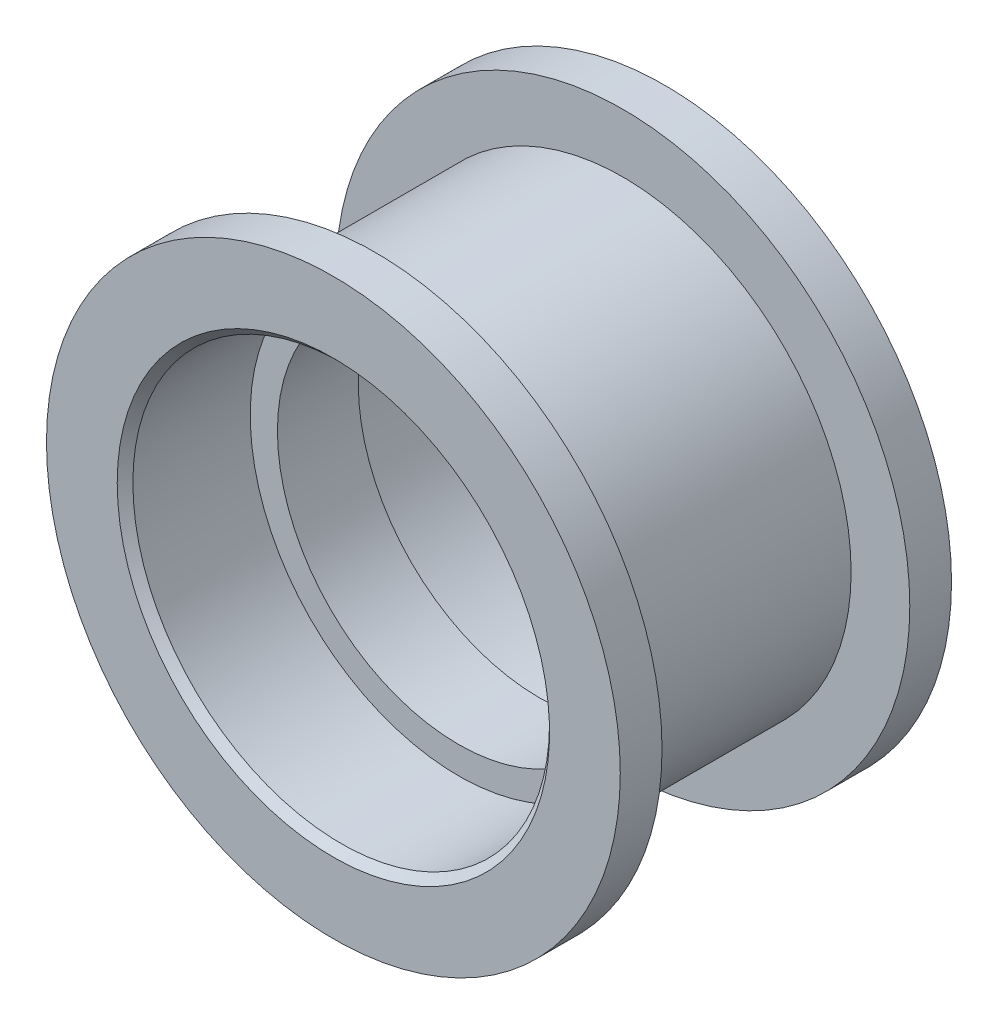
ISO-10303-21;
HEADER;
FILE_DESCRIPTION(('STEP AP214'),'2;1');
FILE_NAME('part.step','',(''),(''),'','','');
FILE_SCHEMA(('AUTOMOTIVE_DESIGN { 1 0 10303 214 1 1 1 1 }'));
ENDSEC;
DATA;
#1=APPLICATION_CONTEXT('core data for automotive mechanical design processes');
#2=APPLICATION_PROTOCOL_DEFINITION('international standard','automotive_design',2000,#1);
#3=PRODUCT_CONTEXT('',#1,'mechanical');
#4=PRODUCT('Part','Part','',(#3));
#5=PRODUCT_RELATED_PRODUCT_CATEGORY('part','',(#4));
#6=PRODUCT_DEFINITION_FORMATION('','',#4);
#7=PRODUCT_DEFINITION_CONTEXT('part definition',#1,'design');
#8=PRODUCT_DEFINITION('design','',#6,#7);
#9=PRODUCT_DEFINITION_SHAPE('','',#8);
#10=(LENGTH_UNIT() NAMED_UNIT(*) SI_UNIT(.MILLI.,.METRE.));
#11=(NAMED_UNIT(*) PLANE_ANGLE_UNIT() SI_UNIT($,.RADIAN.));
#12=(NAMED_UNIT(*) SI_UNIT($,.STERADIAN.) SOLID_ANGLE_UNIT());
#13=UNCERTAINTY_MEASURE_WITH_UNIT(LENGTH_MEASURE(1.E-05),#10,'distance_accuracy_value','');
#14=(GEOMETRIC_REPRESENTATION_CONTEXT(3) GLOBAL_UNCERTAINTY_ASSIGNED_CONTEXT((#13)) GLOBAL_UNIT_ASSIGNED_CONTEXT((#10,
#11,#12)) REPRESENTATION_CONTEXT('',''));
#15=CARTESIAN_POINT('',(0.,0.,0.));
#16=DIRECTION('',(0.,0.,1.));
#17=DIRECTION('',(1.,0.,0.));
#18=AXIS2_PLACEMENT_3D('',#15,#16,#17);
#19=CARTESIAN_POINT('',(0.,0.,0.));
#20=DIRECTION('',(0.,0.,1.));
#21=DIRECTION('',(1.,0.,0.));
#22=AXIS2_PLACEMENT_3D('',#19,#20,#21);
#23=CYLINDRICAL_SURFACE('',#22,6.945);
#24=CARTESIAN_POINT('',(0.,0.,-1.55));
#25=DIRECTION('',(0.,0.,1.));
#26=DIRECTION('',(1.,0.,0.));
#27=AXIS2_PLACEMENT_3D('',#24,#25,#26);
#28=CIRCLE('',#27,6.945);
#29=CARTESIAN_POINT('',(6.945,0.,-1.55));
#30=VERTEX_POINT('',#29);
#31=EDGE_CURVE('E78',#30,#30,#28,.T.);
#32=ORIENTED_EDGE('',*,*,#31,.F.);
#33=EDGE_LOOP('',(#32));
#34=FACE_BOUND('',#33,.T.);
#35=CARTESIAN_POINT('',(0.,0.,1.55));
#36=DIRECTION('',(0.,0.,1.));
#37=DIRECTION('',(1.,0.,0.));
#38=AXIS2_PLACEMENT_3D('',#35,#36,#37);
#39=CIRCLE('',#38,6.945);
#40=CARTESIAN_POINT('',(6.945,0.,1.55));
#41=VERTEX_POINT('',#40);
#42=EDGE_CURVE('E51',#41,#41,#39,.T.);
#43=ORIENTED_EDGE('',*,*,#42,.T.);
#44=EDGE_LOOP('',(#43));
#45=FACE_BOUND('',#44,.T.);
#46=ADVANCED_FACE('F31',(#34,#45),#23,.F.);
#47=CARTESIAN_POINT('',(0.,7.9875,1.55));
#48=DIRECTION('',(0.,0.,-1.));
#49=DIRECTION('',(-1.,0.,0.));
#50=AXIS2_PLACEMENT_3D('',#47,#48,#49);
#51=PLANE('',#50);
#52=ORIENTED_EDGE('',*,*,#42,.F.);
#53=EDGE_LOOP('',(#52));
#54=FACE_BOUND('',#53,.T.);
#55=CARTESIAN_POINT('',(0.,0.,1.55));
#56=DIRECTION('',(0.,0.,1.));
#57=DIRECTION('',(1.,0.,0.));
#58=AXIS2_PLACEMENT_3D('',#55,#56,#57);
#59=CIRCLE('',#58,7.9875);
#60=CARTESIAN_POINT('',(7.9875,0.,1.55));
#61=VERTEX_POINT('',#60);
#62=EDGE_CURVE('E54',#61,#61,#59,.T.);
#63=ORIENTED_EDGE('',*,*,#62,.T.);
#64=EDGE_LOOP('',(#63));
#65=FACE_BOUND('',#64,.T.);
#66=ADVANCED_FACE('F86',(#54,#65),#51,.F.);
#67=CARTESIAN_POINT('',(0.,0.,0.));
#68=DIRECTION('',(0.,0.,1.));
#69=DIRECTION('',(1.,0.,0.));
#70=AXIS2_PLACEMENT_3D('',#67,#68,#69);
#71=CYLINDRICAL_SURFACE('',#70,7.9875);
#72=CARTESIAN_POINT('',(0.,0.,6.05000000000001));
#73=DIRECTION('',(0.,0.,-1.));
#74=DIRECTION('',(-1.,0.,0.));
#75=AXIS2_PLACEMENT_3D('',#72,#73,#74);
#76=CIRCLE('',#75,7.9875);
#77=CARTESIAN_POINT('',(-7.9875,0.,6.05000000000001));
#78=VERTEX_POINT('',#77);
#79=EDGE_CURVE('E38',#78,#78,#76,.F.);
#80=ORIENTED_EDGE('',*,*,#79,.T.);
#81=EDGE_LOOP('',(#80));
#82=FACE_BOUND('',#81,.T.);
#83=ORIENTED_EDGE('',*,*,#62,.F.);
#84=EDGE_LOOP('',(#83));
#85=FACE_BOUND('',#84,.T.);
#86=ADVANCED_FACE('F92',(#82,#85),#71,.F.);
#87=CARTESIAN_POINT('',(0.,11.,6.35));
#88=DIRECTION('',(0.,0.,-1.));
#89=DIRECTION('',(-1.,0.,0.));
#90=AXIS2_PLACEMENT_3D('',#87,#88,#89);
#91=PLANE('',#90);
#92=CARTESIAN_POINT('',(0.,0.,6.35));
#93=DIRECTION('',(0.,0.,-1.));
#94=DIRECTION('',(-1.,0.,0.));
#95=AXIS2_PLACEMENT_3D('',#92,#93,#94);
#96=CIRCLE('',#95,8.28749999999999);
#97=CARTESIAN_POINT('',(-8.28749999999999,0.,6.35));
#98=VERTEX_POINT('',#97);
#99=EDGE_CURVE('E10',#98,#98,#96,.T.);
#100=ORIENTED_EDGE('',*,*,#99,.T.);
#101=EDGE_LOOP('',(#100));
#102=FACE_BOUND('',#101,.T.);
#103=CARTESIAN_POINT('',(0.,0.,6.35));
#104=DIRECTION('',(0.,0.,1.));
#105=DIRECTION('',(1.,0.,0.));
#106=AXIS2_PLACEMENT_3D('',#103,#104,#105);
#107=CIRCLE('',#106,11.);
#108=CARTESIAN_POINT('',(11.,0.,6.35));
#109=VERTEX_POINT('',#108);
#110=EDGE_CURVE('E57',#109,#109,#107,.T.);
#111=ORIENTED_EDGE('',*,*,#110,.T.);
#112=EDGE_LOOP('',(#111));
#113=FACE_BOUND('',#112,.T.);
#114=ADVANCED_FACE('F97',(#102,#113),#91,.F.);
#115=CARTESIAN_POINT('',(0.,0.,0.));
#116=DIRECTION('',(0.,0.,1.));
#117=DIRECTION('',(1.,0.,0.));
#118=AXIS2_PLACEMENT_3D('',#115,#116,#117);
#119=CYLINDRICAL_SURFACE('',#118,11.);
#120=ORIENTED_EDGE('',*,*,#110,.F.);
#121=EDGE_LOOP('',(#120));
#122=FACE_BOUND('',#121,.T.);
#123=CARTESIAN_POINT('',(0.,0.,4.75));
#124=DIRECTION('',(0.,0.,1.));
#125=DIRECTION('',(1.,0.,0.));
#126=AXIS2_PLACEMENT_3D('',#123,#124,#125);
#127=CIRCLE('',#126,11.);
#128=CARTESIAN_POINT('',(11.,0.,4.75));
#129=VERTEX_POINT('',#128);
#130=EDGE_CURVE('E60',#129,#129,#127,.T.);
#131=ORIENTED_EDGE('',*,*,#130,.T.);
#132=EDGE_LOOP('',(#131));
#133=FACE_BOUND('',#132,.T.);
#134=ADVANCED_FACE('F102',(#122,#133),#119,.T.);
#135=CARTESIAN_POINT('',(0.,8.75,4.75));
#136=DIRECTION('',(0.,0.,1.));
#137=DIRECTION('',(1.,0.,0.));
#138=AXIS2_PLACEMENT_3D('',#135,#136,#137);
#139=PLANE('',#138);
#140=ORIENTED_EDGE('',*,*,#130,.F.);
#141=EDGE_LOOP('',(#140));
#142=FACE_BOUND('',#141,.T.);
#143=CARTESIAN_POINT('',(0.,0.,4.75));
#144=DIRECTION('',(0.,0.,1.));
#145=DIRECTION('',(1.,0.,0.));
#146=AXIS2_PLACEMENT_3D('',#143,#144,#145);
#147=CIRCLE('',#146,8.75);
#148=CARTESIAN_POINT('',(8.75,0.,4.75));
#149=VERTEX_POINT('',#148);
#150=EDGE_CURVE('E63',#149,#149,#147,.T.);
#151=ORIENTED_EDGE('',*,*,#150,.T.);
#152=EDGE_LOOP('',(#151));
#153=FACE_BOUND('',#152,.T.);
#154=ADVANCED_FACE('F142',(#142,#153),#139,.F.);
#155=CARTESIAN_POINT('',(0.,0.,0.));
#156=DIRECTION('',(0.,0.,1.));
#157=DIRECTION('',(1.,0.,0.));
#158=AXIS2_PLACEMENT_3D('',#155,#156,#157);
#159=CYLINDRICAL_SURFACE('',#158,8.75);
#160=ORIENTED_EDGE('',*,*,#150,.F.);
#161=EDGE_LOOP('',(#160));
#162=FACE_BOUND('',#161,.T.);
#163=CARTESIAN_POINT('',(0.,0.,-4.75));
#164=DIRECTION('',(0.,0.,1.));
#165=DIRECTION('',(1.,0.,0.));
#166=AXIS2_PLACEMENT_3D('',#163,#164,#165);
#167=CIRCLE('',#166,8.75);
#168=CARTESIAN_POINT('',(8.75,0.,-4.75));
#169=VERTEX_POINT('',#168);
#170=EDGE_CURVE('E66',#169,#169,#167,.T.);
#171=ORIENTED_EDGE('',*,*,#170,.T.);
#172=EDGE_LOOP('',(#171));
#173=FACE_BOUND('',#172,.T.);
#174=ADVANCED_FACE('F134',(#162,#173),#159,.T.);
#175=CARTESIAN_POINT('',(0.,8.75,-4.75));
#176=DIRECTION('',(0.,0.,-1.));
#177=DIRECTION('',(-1.,0.,0.));
#178=AXIS2_PLACEMENT_3D('',#175,#176,#177);
#179=PLANE('',#178);
#180=ORIENTED_EDGE('',*,*,#170,.F.);
#181=EDGE_LOOP('',(#180));
#182=FACE_BOUND('',#181,.T.);
#183=CARTESIAN_POINT('',(0.,0.,-4.75));
#184=DIRECTION('',(0.,0.,1.));
#185=DIRECTION('',(1.,0.,0.));
#186=AXIS2_PLACEMENT_3D('',#183,#184,#185);
#187=CIRCLE('',#186,11.);
#188=CARTESIAN_POINT('',(11.,0.,-4.75));
#189=VERTEX_POINT('',#188);
#190=EDGE_CURVE('E69',#189,#189,#187,.T.);
#191=ORIENTED_EDGE('',*,*,#190,.T.);
#192=EDGE_LOOP('',(#191));
#193=FACE_BOUND('',#192,.T.);
#194=ADVANCED_FACE('F128',(#182,#193),#179,.F.);
#195=CARTESIAN_POINT('',(0.,0.,0.));
#196=DIRECTION('',(0.,0.,1.));
#197=DIRECTION('',(1.,0.,0.));
#198=AXIS2_PLACEMENT_3D('',#195,#196,#197);
#199=CYLINDRICAL_SURFACE('',#198,11.);
#200=ORIENTED_EDGE('',*,*,#190,.F.);
#201=EDGE_LOOP('',(#200));
#202=FACE_BOUND('',#201,.T.);
#203=CARTESIAN_POINT('',(0.,0.,-6.35));
#204=DIRECTION('',(0.,0.,1.));
#205=DIRECTION('',(1.,0.,0.));
#206=AXIS2_PLACEMENT_3D('',#203,#204,#205);
#207=CIRCLE('',#206,11.);
#208=CARTESIAN_POINT('',(11.,0.,-6.35));
#209=VERTEX_POINT('',#208);
#210=EDGE_CURVE('E72',#209,#209,#207,.T.);
#211=ORIENTED_EDGE('',*,*,#210,.T.);
#212=EDGE_LOOP('',(#211));
#213=FACE_BOUND('',#212,.T.);
#214=ADVANCED_FACE('F123',(#202,#213),#199,.T.);
#215=CARTESIAN_POINT('',(0.,11.,-6.35));
#216=DIRECTION('',(0.,0.,1.));
#217=DIRECTION('',(1.,0.,0.));
#218=AXIS2_PLACEMENT_3D('',#215,#216,#217);
#219=PLANE('',#218);
#220=CARTESIAN_POINT('',(0.,0.,-6.35));
#221=DIRECTION('',(0.,0.,1.));
#222=DIRECTION('',(1.,0.,0.));
#223=AXIS2_PLACEMENT_3D('',#220,#221,#222);
#224=CIRCLE('',#223,8.28750000000001);
#225=CARTESIAN_POINT('',(8.28750000000001,0.,-6.35));
#226=VERTEX_POINT('',#225);
#227=EDGE_CURVE('E46',#226,#226,#224,.T.);
#228=ORIENTED_EDGE('',*,*,#227,.T.);
#229=EDGE_LOOP('',(#228));
#230=FACE_BOUND('',#229,.T.);
#231=ORIENTED_EDGE('',*,*,#210,.F.);
#232=EDGE_LOOP('',(#231));
#233=FACE_BOUND('',#232,.T.);
#234=ADVANCED_FACE('F120',(#230,#233),#219,.F.);
#235=CARTESIAN_POINT('',(0.,0.,0.));
#236=DIRECTION('',(0.,0.,1.));
#237=DIRECTION('',(1.,0.,0.));
#238=AXIS2_PLACEMENT_3D('',#235,#236,#237);
#239=CYLINDRICAL_SURFACE('',#238,7.9875);
#240=CARTESIAN_POINT('',(0.,0.,-6.04999999999999));
#241=DIRECTION('',(0.,0.,1.));
#242=DIRECTION('',(1.,0.,0.));
#243=AXIS2_PLACEMENT_3D('',#240,#241,#242);
#244=CIRCLE('',#243,7.9875);
#245=CARTESIAN_POINT('',(7.9875,0.,-6.04999999999999));
#246=VERTEX_POINT('',#245);
#247=EDGE_CURVE('E42',#246,#246,#244,.F.);
#248=ORIENTED_EDGE('',*,*,#247,.T.);
#249=EDGE_LOOP('',(#248));
#250=FACE_BOUND('',#249,.T.);
#251=CARTESIAN_POINT('',(0.,0.,-1.55));
#252=DIRECTION('',(0.,0.,1.));
#253=DIRECTION('',(1.,0.,0.));
#254=AXIS2_PLACEMENT_3D('',#251,#252,#253);
#255=CIRCLE('',#254,7.9875);
#256=CARTESIAN_POINT('',(7.9875,0.,-1.55));
#257=VERTEX_POINT('',#256);
#258=EDGE_CURVE('E75',#257,#257,#255,.T.);
#259=ORIENTED_EDGE('',*,*,#258,.T.);
#260=EDGE_LOOP('',(#259));
#261=FACE_BOUND('',#260,.T.);
#262=ADVANCED_FACE('F113',(#250,#261),#239,.F.);
#263=CARTESIAN_POINT('',(0.,7.9875,-1.55));
#264=DIRECTION('',(0.,0.,1.));
#265=DIRECTION('',(1.,0.,0.));
#266=AXIS2_PLACEMENT_3D('',#263,#264,#265);
#267=PLANE('',#266);
#268=ORIENTED_EDGE('',*,*,#258,.F.);
#269=EDGE_LOOP('',(#268));
#270=FACE_BOUND('',#269,.T.);
#271=ORIENTED_EDGE('',*,*,#31,.T.);
#272=EDGE_LOOP('',(#271));
#273=FACE_BOUND('',#272,.T.);
#274=ADVANCED_FACE('F82',(#270,#273),#267,.F.);
#275=CARTESIAN_POINT('',(0.,0.,-6.35));
#276=DIRECTION('',(0.,0.,-1.));
#277=DIRECTION('',(-1.,0.,0.));
#278=AXIS2_PLACEMENT_3D('',#275,#276,#277);
#279=CONICAL_SURFACE('',#278,8.28750000000001,0.785398163397448);
#280=ORIENTED_EDGE('',*,*,#247,.F.);
#281=EDGE_LOOP('',(#280));
#282=FACE_BOUND('',#281,.T.);
#283=ORIENTED_EDGE('',*,*,#227,.F.);
#284=EDGE_LOOP('',(#283));
#285=FACE_BOUND('',#284,.T.);
#286=ADVANCED_FACE('F105',(#282,#285),#279,.F.);
#287=CARTESIAN_POINT('',(0.,0.,6.05000000000001));
#288=DIRECTION('',(0.,0.,1.));
#289=DIRECTION('',(1.,0.,0.));
#290=AXIS2_PLACEMENT_3D('',#287,#288,#289);
#291=CONICAL_SURFACE('',#290,7.9875,0.785398163397448);
#292=ORIENTED_EDGE('',*,*,#99,.F.);
#293=EDGE_LOOP('',(#292));
#294=FACE_BOUND('',#293,.T.);
#295=ORIENTED_EDGE('',*,*,#79,.F.);
#296=EDGE_LOOP('',(#295));
#297=FACE_BOUND('',#296,.T.);
#298=ADVANCED_FACE('F33',(#294,#297),#291,.F.);
#299=CLOSED_SHELL('',(#46,#66,#86,#114,#134,#154,#174,#194,#214,#234,#262,#274,#286,#298));
#300=MANIFOLD_SOLID_BREP('B2',#299);
#301=ADVANCED_BREP_SHAPE_REPRESENTATION('',(#18,#300),#14);
#302=SHAPE_DEFINITION_REPRESENTATION(#9,#301);
ENDSEC;
END-ISO-10303-21;
